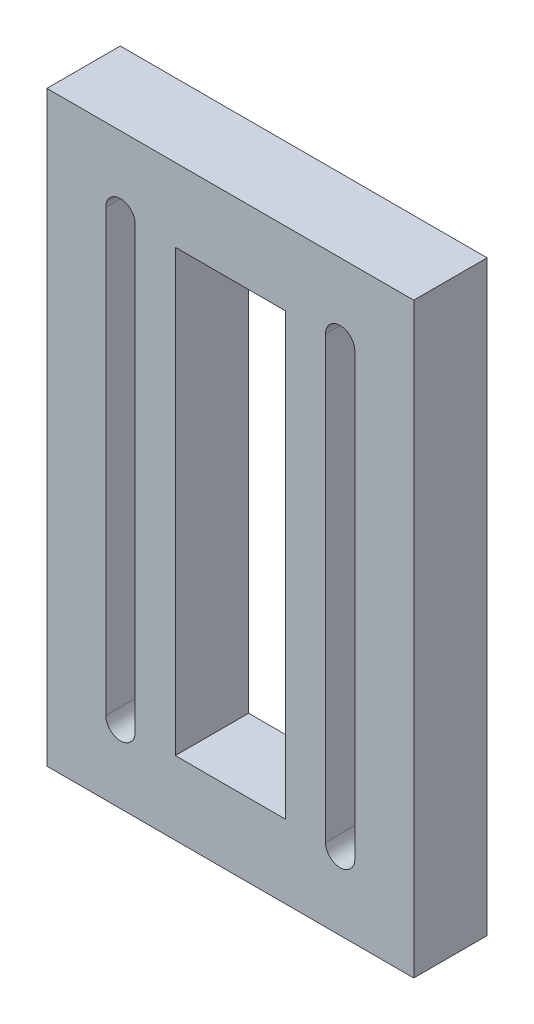
ISO-10303-21;
HEADER;
FILE_DESCRIPTION(('STEP AP214'),'2;1');
FILE_NAME('part.step','',(''),(''),'','','');
FILE_SCHEMA(('AUTOMOTIVE_DESIGN { 1 0 10303 214 1 1 1 1 }'));
ENDSEC;
DATA;
#1=APPLICATION_CONTEXT('core data for automotive mechanical design processes');
#2=APPLICATION_PROTOCOL_DEFINITION('international standard','automotive_design',2000,#1);
#3=PRODUCT_CONTEXT('',#1,'mechanical');
#4=PRODUCT('Part','Part','',(#3));
#5=PRODUCT_RELATED_PRODUCT_CATEGORY('part','',(#4));
#6=PRODUCT_DEFINITION_FORMATION('','',#4);
#7=PRODUCT_DEFINITION_CONTEXT('part definition',#1,'design');
#8=PRODUCT_DEFINITION('design','',#6,#7);
#9=PRODUCT_DEFINITION_SHAPE('','',#8);
#10=(LENGTH_UNIT() NAMED_UNIT(*) SI_UNIT(.MILLI.,.METRE.));
#11=(NAMED_UNIT(*) PLANE_ANGLE_UNIT() SI_UNIT($,.RADIAN.));
#12=(NAMED_UNIT(*) SI_UNIT($,.STERADIAN.) SOLID_ANGLE_UNIT());
#13=UNCERTAINTY_MEASURE_WITH_UNIT(LENGTH_MEASURE(1.E-05),#10,'distance_accuracy_value','');
#14=(GEOMETRIC_REPRESENTATION_CONTEXT(3) GLOBAL_UNCERTAINTY_ASSIGNED_CONTEXT((#13)) GLOBAL_UNIT_ASSIGNED_CONTEXT((#10,
#11,#12)) REPRESENTATION_CONTEXT('',''));
#15=CARTESIAN_POINT('',(0.,0.,0.));
#16=DIRECTION('',(0.,0.,1.));
#17=DIRECTION('',(1.,0.,0.));
#18=AXIS2_PLACEMENT_3D('',#15,#16,#17);
#19=CARTESIAN_POINT('',(20.0334967028434,0.,10.));
#20=DIRECTION('',(-1.,0.,0.));
#21=DIRECTION('',(0.,0.,1.));
#22=AXIS2_PLACEMENT_3D('',#19,#20,#21);
#23=PLANE('',#22);
#24=DIRECTION('',(0.,1.,0.));
#25=VECTOR('',#24,1.);
#26=CARTESIAN_POINT('',(20.0334967028434,0.,0.));
#27=LINE('',#26,#25);
#28=CARTESIAN_POINT('',(20.0334967028434,-30.,0.));
#29=VERTEX_POINT('',#28);
#30=CARTESIAN_POINT('',(20.0334967028434,30.,0.));
#31=VERTEX_POINT('',#30);
#32=EDGE_CURVE('E214',#29,#31,#27,.T.);
#33=ORIENTED_EDGE('',*,*,#32,.F.);
#34=DIRECTION('',(0.,0.,-1.));
#35=VECTOR('',#34,1.);
#36=CARTESIAN_POINT('',(20.0334967028434,-30.,10.));
#37=LINE('',#36,#35);
#38=CARTESIAN_POINT('',(20.0334967028434,-30.,10.));
#39=VERTEX_POINT('',#38);
#40=EDGE_CURVE('E11',#39,#29,#37,.T.);
#41=ORIENTED_EDGE('',*,*,#40,.F.);
#42=DIRECTION('',(0.,1.,0.));
#43=VECTOR('',#42,1.);
#44=CARTESIAN_POINT('',(20.0334967028434,0.,10.));
#45=LINE('',#44,#43);
#46=CARTESIAN_POINT('',(20.0334967028434,30.,10.));
#47=VERTEX_POINT('',#46);
#48=EDGE_CURVE('E164',#39,#47,#45,.T.);
#49=ORIENTED_EDGE('',*,*,#48,.T.);
#50=DIRECTION('',(0.,0.,-1.));
#51=VECTOR('',#50,1.);
#52=CARTESIAN_POINT('',(20.0334967028434,30.,10.));
#53=LINE('',#52,#51);
#54=EDGE_CURVE('E113',#47,#31,#53,.T.);
#55=ORIENTED_EDGE('',*,*,#54,.T.);
#56=EDGE_LOOP('',(#33,#41,#49,#55));
#57=FACE_BOUND('',#56,.T.);
#58=ADVANCED_FACE('F36',(#57),#23,.T.);
#59=CARTESIAN_POINT('',(18.0334967028434,-30.,10.));
#60=DIRECTION('',(0.,0.,-1.));
#61=DIRECTION('',(-1.,0.,0.));
#62=AXIS2_PLACEMENT_3D('',#59,#60,#61);
#63=CYLINDRICAL_SURFACE('',#62,2.);
#64=CARTESIAN_POINT('',(18.0334967028434,-30.,0.));
#65=DIRECTION('',(0.,0.,1.));
#66=DIRECTION('',(1.,0.,0.));
#67=AXIS2_PLACEMENT_3D('',#64,#65,#66);
#68=CIRCLE('',#67,2.);
#69=CARTESIAN_POINT('',(16.0334967028434,-30.,0.));
#70=VERTEX_POINT('',#69);
#71=EDGE_CURVE('E170',#29,#70,#68,.F.);
#72=ORIENTED_EDGE('',*,*,#71,.T.);
#73=DIRECTION('',(0.,0.,-1.));
#74=VECTOR('',#73,1.);
#75=CARTESIAN_POINT('',(16.0334967028434,-30.,10.));
#76=LINE('',#75,#74);
#77=CARTESIAN_POINT('',(16.0334967028434,-30.,10.));
#78=VERTEX_POINT('',#77);
#79=EDGE_CURVE('E46',#78,#70,#76,.T.);
#80=ORIENTED_EDGE('',*,*,#79,.F.);
#81=CARTESIAN_POINT('',(18.0334967028434,-30.,10.));
#82=DIRECTION('',(0.,0.,1.));
#83=DIRECTION('',(1.,0.,0.));
#84=AXIS2_PLACEMENT_3D('',#81,#82,#83);
#85=CIRCLE('',#84,2.);
#86=EDGE_CURVE('E159',#39,#78,#85,.F.);
#87=ORIENTED_EDGE('',*,*,#86,.F.);
#88=ORIENTED_EDGE('',*,*,#40,.T.);
#89=EDGE_LOOP('',(#72,#80,#87,#88));
#90=FACE_BOUND('',#89,.T.);
#91=ADVANCED_FACE('F168',(#90),#63,.F.);
#92=CARTESIAN_POINT('',(16.0334967028434,0.,10.));
#93=DIRECTION('',(1.,0.,0.));
#94=DIRECTION('',(0.,1.,0.));
#95=AXIS2_PLACEMENT_3D('',#92,#93,#94);
#96=PLANE('',#95);
#97=DIRECTION('',(0.,-1.,0.));
#98=VECTOR('',#97,1.);
#99=CARTESIAN_POINT('',(16.0334967028434,0.,0.));
#100=LINE('',#99,#98);
#101=CARTESIAN_POINT('',(16.0334967028434,30.,0.));
#102=VERTEX_POINT('',#101);
#103=EDGE_CURVE('E218',#102,#70,#100,.T.);
#104=ORIENTED_EDGE('',*,*,#103,.F.);
#105=DIRECTION('',(0.,0.,-1.));
#106=VECTOR('',#105,1.);
#107=CARTESIAN_POINT('',(16.0334967028434,30.,10.));
#108=LINE('',#107,#106);
#109=CARTESIAN_POINT('',(16.0334967028434,30.,10.));
#110=VERTEX_POINT('',#109);
#111=EDGE_CURVE('E106',#110,#102,#108,.T.);
#112=ORIENTED_EDGE('',*,*,#111,.F.);
#113=DIRECTION('',(0.,-1.,0.));
#114=VECTOR('',#113,1.);
#115=CARTESIAN_POINT('',(16.0334967028434,0.,10.));
#116=LINE('',#115,#114);
#117=EDGE_CURVE('E163',#110,#78,#116,.T.);
#118=ORIENTED_EDGE('',*,*,#117,.T.);
#119=ORIENTED_EDGE('',*,*,#79,.T.);
#120=EDGE_LOOP('',(#104,#112,#118,#119));
#121=FACE_BOUND('',#120,.T.);
#122=ADVANCED_FACE('F175',(#121),#96,.T.);
#123=CARTESIAN_POINT('',(-11.9040776644208,-30.,10.));
#124=DIRECTION('',(0.,0.,-1.));
#125=DIRECTION('',(-1.,0.,0.));
#126=AXIS2_PLACEMENT_3D('',#123,#124,#125);
#127=CYLINDRICAL_SURFACE('',#126,2.);
#128=CARTESIAN_POINT('',(-11.9040776644208,-30.,0.));
#129=DIRECTION('',(0.,0.,1.));
#130=DIRECTION('',(1.,0.,0.));
#131=AXIS2_PLACEMENT_3D('',#128,#129,#130);
#132=CIRCLE('',#131,2.);
#133=CARTESIAN_POINT('',(-13.9040776644208,-30.,0.));
#134=VERTEX_POINT('',#133);
#135=CARTESIAN_POINT('',(-9.90407766442081,-30.,0.));
#136=VERTEX_POINT('',#135);
#137=EDGE_CURVE('E202',#134,#136,#132,.T.);
#138=ORIENTED_EDGE('',*,*,#137,.F.);
#139=DIRECTION('',(0.,0.,-1.));
#140=VECTOR('',#139,1.);
#141=CARTESIAN_POINT('',(-13.9040776644208,-30.,10.));
#142=LINE('',#141,#140);
#143=CARTESIAN_POINT('',(-13.9040776644208,-30.,10.));
#144=VERTEX_POINT('',#143);
#145=EDGE_CURVE('E224',#144,#134,#142,.T.);
#146=ORIENTED_EDGE('',*,*,#145,.F.);
#147=CARTESIAN_POINT('',(-11.9040776644208,-30.,10.));
#148=DIRECTION('',(0.,0.,1.));
#149=DIRECTION('',(1.,0.,0.));
#150=AXIS2_PLACEMENT_3D('',#147,#148,#149);
#151=CIRCLE('',#150,2.);
#152=CARTESIAN_POINT('',(-9.90407766442081,-30.,10.));
#153=VERTEX_POINT('',#152);
#154=EDGE_CURVE('E285',#144,#153,#151,.T.);
#155=ORIENTED_EDGE('',*,*,#154,.T.);
#156=DIRECTION('',(0.,0.,-1.));
#157=VECTOR('',#156,1.);
#158=CARTESIAN_POINT('',(-9.90407766442081,-30.,10.));
#159=LINE('',#158,#157);
#160=EDGE_CURVE('E226',#153,#136,#159,.T.);
#161=ORIENTED_EDGE('',*,*,#160,.T.);
#162=EDGE_LOOP('',(#138,#146,#155,#161));
#163=FACE_BOUND('',#162,.T.);
#164=ADVANCED_FACE('F327',(#163),#127,.F.);
#165=CARTESIAN_POINT('',(-13.9040776644208,0.,10.));
#166=DIRECTION('',(1.,0.,0.));
#167=DIRECTION('',(0.,1.,0.));
#168=AXIS2_PLACEMENT_3D('',#165,#166,#167);
#169=PLANE('',#168);
#170=DIRECTION('',(0.,-1.,0.));
#171=VECTOR('',#170,1.);
#172=CARTESIAN_POINT('',(-13.9040776644208,0.,0.));
#173=LINE('',#172,#171);
#174=CARTESIAN_POINT('',(-13.9040776644208,30.,0.));
#175=VERTEX_POINT('',#174);
#176=EDGE_CURVE('E205',#175,#134,#173,.T.);
#177=ORIENTED_EDGE('',*,*,#176,.F.);
#178=DIRECTION('',(0.,0.,-1.));
#179=VECTOR('',#178,1.);
#180=CARTESIAN_POINT('',(-13.9040776644208,30.,10.));
#181=LINE('',#180,#179);
#182=CARTESIAN_POINT('',(-13.9040776644208,30.,10.));
#183=VERTEX_POINT('',#182);
#184=EDGE_CURVE('E232',#183,#175,#181,.T.);
#185=ORIENTED_EDGE('',*,*,#184,.F.);
#186=DIRECTION('',(0.,-1.,0.));
#187=VECTOR('',#186,1.);
#188=CARTESIAN_POINT('',(-13.9040776644208,0.,10.));
#189=LINE('',#188,#187);
#190=EDGE_CURVE('E288',#183,#144,#189,.T.);
#191=ORIENTED_EDGE('',*,*,#190,.T.);
#192=ORIENTED_EDGE('',*,*,#145,.T.);
#193=EDGE_LOOP('',(#177,#185,#191,#192));
#194=FACE_BOUND('',#193,.T.);
#195=ADVANCED_FACE('F323',(#194),#169,.T.);
#196=CARTESIAN_POINT('',(-11.9040776644208,30.,10.));
#197=DIRECTION('',(0.,0.,-1.));
#198=DIRECTION('',(-1.,0.,0.));
#199=AXIS2_PLACEMENT_3D('',#196,#197,#198);
#200=CYLINDRICAL_SURFACE('',#199,2.);
#201=CARTESIAN_POINT('',(-11.9040776644208,30.,0.));
#202=DIRECTION('',(0.,0.,1.));
#203=DIRECTION('',(1.,0.,0.));
#204=AXIS2_PLACEMENT_3D('',#201,#202,#203);
#205=CIRCLE('',#204,2.);
#206=CARTESIAN_POINT('',(-9.90407766442082,30.,0.));
#207=VERTEX_POINT('',#206);
#208=EDGE_CURVE('E208',#175,#207,#205,.F.);
#209=ORIENTED_EDGE('',*,*,#208,.T.);
#210=DIRECTION('',(0.,0.,-1.));
#211=VECTOR('',#210,1.);
#212=CARTESIAN_POINT('',(-9.90407766442082,30.,10.));
#213=LINE('',#212,#211);
#214=CARTESIAN_POINT('',(-9.90407766442082,30.,10.));
#215=VERTEX_POINT('',#214);
#216=EDGE_CURVE('E228',#215,#207,#213,.T.);
#217=ORIENTED_EDGE('',*,*,#216,.F.);
#218=CARTESIAN_POINT('',(-11.9040776644208,30.,10.));
#219=DIRECTION('',(0.,0.,1.));
#220=DIRECTION('',(1.,0.,0.));
#221=AXIS2_PLACEMENT_3D('',#218,#219,#220);
#222=CIRCLE('',#221,2.);
#223=EDGE_CURVE('E291',#183,#215,#222,.F.);
#224=ORIENTED_EDGE('',*,*,#223,.F.);
#225=ORIENTED_EDGE('',*,*,#184,.T.);
#226=EDGE_LOOP('',(#209,#217,#224,#225));
#227=FACE_BOUND('',#226,.T.);
#228=ADVANCED_FACE('F319',(#227),#200,.F.);
#229=CARTESIAN_POINT('',(28.0647095192113,0.,10.));
#230=DIRECTION('',(1.,0.,0.));
#231=DIRECTION('',(0.,0.,-1.));
#232=AXIS2_PLACEMENT_3D('',#229,#230,#231);
#233=PLANE('',#232);
#234=DIRECTION('',(0.,-1.,0.));
#235=VECTOR('',#234,1.);
#236=CARTESIAN_POINT('',(28.0647095192113,0.,0.));
#237=LINE('',#236,#235);
#238=CARTESIAN_POINT('',(28.0647095192113,40.,0.));
#239=VERTEX_POINT('',#238);
#240=CARTESIAN_POINT('',(28.0647095192113,-40.,0.));
#241=VERTEX_POINT('',#240);
#242=EDGE_CURVE('E190',#239,#241,#237,.T.);
#243=ORIENTED_EDGE('',*,*,#242,.F.);
#244=DIRECTION('',(0.,0.,-1.));
#245=VECTOR('',#244,1.);
#246=CARTESIAN_POINT('',(28.0647095192113,40.,10.));
#247=LINE('',#246,#245);
#248=CARTESIAN_POINT('',(28.0647095192113,40.,10.));
#249=VERTEX_POINT('',#248);
#250=EDGE_CURVE('E229',#249,#239,#247,.T.);
#251=ORIENTED_EDGE('',*,*,#250,.F.);
#252=DIRECTION('',(0.,-1.,0.));
#253=VECTOR('',#252,1.);
#254=CARTESIAN_POINT('',(28.0647095192113,0.,10.));
#255=LINE('',#254,#253);
#256=CARTESIAN_POINT('',(28.0647095192113,-40.,10.));
#257=VERTEX_POINT('',#256);
#258=EDGE_CURVE('E269',#249,#257,#255,.T.);
#259=ORIENTED_EDGE('',*,*,#258,.T.);
#260=DIRECTION('',(0.,0.,-1.));
#261=VECTOR('',#260,1.);
#262=CARTESIAN_POINT('',(28.0647095192113,-40.,10.));
#263=LINE('',#262,#261);
#264=EDGE_CURVE('E235',#257,#241,#263,.T.);
#265=ORIENTED_EDGE('',*,*,#264,.T.);
#266=EDGE_LOOP('',(#243,#251,#259,#265));
#267=FACE_BOUND('',#266,.T.);
#268=ADVANCED_FACE('F322',(#267),#233,.T.);
#269=CARTESIAN_POINT('',(0.,40.,10.));
#270=DIRECTION('',(0.,1.,0.));
#271=DIRECTION('',(0.,0.,1.));
#272=AXIS2_PLACEMENT_3D('',#269,#270,#271);
#273=PLANE('',#272);
#274=DIRECTION('',(1.,0.,0.));
#275=VECTOR('',#274,1.);
#276=CARTESIAN_POINT('',(0.,40.,0.));
#277=LINE('',#276,#275);
#278=CARTESIAN_POINT('',(-21.9352904807887,40.,0.));
#279=VERTEX_POINT('',#278);
#280=EDGE_CURVE('E193',#279,#239,#277,.T.);
#281=ORIENTED_EDGE('',*,*,#280,.F.);
#282=DIRECTION('',(0.,0.,-1.));
#283=VECTOR('',#282,1.);
#284=CARTESIAN_POINT('',(-21.9352904807887,40.,10.));
#285=LINE('',#284,#283);
#286=CARTESIAN_POINT('',(-21.9352904807887,40.,10.));
#287=VERTEX_POINT('',#286);
#288=EDGE_CURVE('E240',#287,#279,#285,.T.);
#289=ORIENTED_EDGE('',*,*,#288,.F.);
#290=DIRECTION('',(1.,0.,0.));
#291=VECTOR('',#290,1.);
#292=CARTESIAN_POINT('',(0.,40.,10.));
#293=LINE('',#292,#291);
#294=EDGE_CURVE('E273',#287,#249,#293,.T.);
#295=ORIENTED_EDGE('',*,*,#294,.T.);
#296=ORIENTED_EDGE('',*,*,#250,.T.);
#297=EDGE_LOOP('',(#281,#289,#295,#296));
#298=FACE_BOUND('',#297,.T.);
#299=ADVANCED_FACE('F338',(#298),#273,.T.);
#300=CARTESIAN_POINT('',(-21.9352904807887,0.,10.));
#301=DIRECTION('',(1.,0.,0.));
#302=DIRECTION('',(0.,0.,-1.));
#303=AXIS2_PLACEMENT_3D('',#300,#301,#302);
#304=PLANE('',#303);
#305=DIRECTION('',(0.,-1.,0.));
#306=VECTOR('',#305,1.);
#307=CARTESIAN_POINT('',(-21.9352904807887,0.,0.));
#308=LINE('',#307,#306);
#309=CARTESIAN_POINT('',(-21.9352904807887,-40.,0.));
#310=VERTEX_POINT('',#309);
#311=EDGE_CURVE('E196',#279,#310,#308,.T.);
#312=ORIENTED_EDGE('',*,*,#311,.T.);
#313=DIRECTION('',(0.,0.,-1.));
#314=VECTOR('',#313,1.);
#315=CARTESIAN_POINT('',(-21.9352904807887,-40.,10.));
#316=LINE('',#315,#314);
#317=CARTESIAN_POINT('',(-21.9352904807887,-40.,10.));
#318=VERTEX_POINT('',#317);
#319=EDGE_CURVE('E237',#318,#310,#316,.T.);
#320=ORIENTED_EDGE('',*,*,#319,.F.);
#321=DIRECTION('',(0.,-1.,0.));
#322=VECTOR('',#321,1.);
#323=CARTESIAN_POINT('',(-21.9352904807887,0.,10.));
#324=LINE('',#323,#322);
#325=EDGE_CURVE('E280',#287,#318,#324,.T.);
#326=ORIENTED_EDGE('',*,*,#325,.F.);
#327=ORIENTED_EDGE('',*,*,#288,.T.);
#328=EDGE_LOOP('',(#312,#320,#326,#327));
#329=FACE_BOUND('',#328,.T.);
#330=ADVANCED_FACE('F335',(#329),#304,.F.);
#331=CARTESIAN_POINT('',(0.,-30.,10.));
#332=DIRECTION('',(0.,-1.,0.));
#333=DIRECTION('',(1.,0.,0.));
#334=AXIS2_PLACEMENT_3D('',#331,#332,#333);
#335=PLANE('',#334);
#336=DIRECTION('',(-1.,0.,0.));
#337=VECTOR('',#336,1.);
#338=CARTESIAN_POINT('',(0.,-30.,0.));
#339=LINE('',#338,#337);
#340=CARTESIAN_POINT('',(10.5647095192113,-30.,0.));
#341=VERTEX_POINT('',#340);
#342=CARTESIAN_POINT('',(-4.43529048078872,-30.,0.));
#343=VERTEX_POINT('',#342);
#344=EDGE_CURVE('E181',#341,#343,#339,.T.);
#345=ORIENTED_EDGE('',*,*,#344,.T.);
#346=DIRECTION('',(0.,0.,-1.));
#347=VECTOR('',#346,1.);
#348=CARTESIAN_POINT('',(-4.43529048078872,-30.,10.));
#349=LINE('',#348,#347);
#350=CARTESIAN_POINT('',(-4.43529048078872,-30.,10.));
#351=VERTEX_POINT('',#350);
#352=EDGE_CURVE('E40',#351,#343,#349,.T.);
#353=ORIENTED_EDGE('',*,*,#352,.F.);
#354=DIRECTION('',(-1.,0.,0.));
#355=VECTOR('',#354,1.);
#356=CARTESIAN_POINT('',(0.,-30.,10.));
#357=LINE('',#356,#355);
#358=CARTESIAN_POINT('',(10.5647095192113,-30.,10.));
#359=VERTEX_POINT('',#358);
#360=EDGE_CURVE('E222',#359,#351,#357,.T.);
#361=ORIENTED_EDGE('',*,*,#360,.F.);
#362=DIRECTION('',(0.,0.,-1.));
#363=VECTOR('',#362,1.);
#364=CARTESIAN_POINT('',(10.5647095192113,-30.,10.));
#365=LINE('',#364,#363);
#366=EDGE_CURVE('E177',#359,#341,#365,.T.);
#367=ORIENTED_EDGE('',*,*,#366,.T.);
#368=EDGE_LOOP('',(#345,#353,#361,#367));
#369=FACE_BOUND('',#368,.T.);
#370=ADVANCED_FACE('F38',(#369),#335,.F.);
#371=CARTESIAN_POINT('',(-4.43529048078872,0.,10.));
#372=DIRECTION('',(-1.,0.,0.));
#373=DIRECTION('',(0.,0.,1.));
#374=AXIS2_PLACEMENT_3D('',#371,#372,#373);
#375=PLANE('',#374);
#376=DIRECTION('',(0.,1.,0.));
#377=VECTOR('',#376,1.);
#378=CARTESIAN_POINT('',(-4.43529048078872,0.,0.));
#379=LINE('',#378,#377);
#380=CARTESIAN_POINT('',(-4.43529048078872,30.,0.));
#381=VERTEX_POINT('',#380);
#382=EDGE_CURVE('E184',#343,#381,#379,.T.);
#383=ORIENTED_EDGE('',*,*,#382,.T.);
#384=DIRECTION('',(0.,0.,-1.));
#385=VECTOR('',#384,1.);
#386=CARTESIAN_POINT('',(-4.43529048078872,30.,10.));
#387=LINE('',#386,#385);
#388=CARTESIAN_POINT('',(-4.43529048078872,30.,10.));
#389=VERTEX_POINT('',#388);
#390=EDGE_CURVE('E247',#389,#381,#387,.T.);
#391=ORIENTED_EDGE('',*,*,#390,.F.);
#392=DIRECTION('',(0.,1.,0.));
#393=VECTOR('',#392,1.);
#394=CARTESIAN_POINT('',(-4.43529048078872,0.,10.));
#395=LINE('',#394,#393);
#396=EDGE_CURVE('E121',#351,#389,#395,.T.);
#397=ORIENTED_EDGE('',*,*,#396,.F.);
#398=ORIENTED_EDGE('',*,*,#352,.T.);
#399=EDGE_LOOP('',(#383,#391,#397,#398));
#400=FACE_BOUND('',#399,.T.);
#401=ADVANCED_FACE('F253',(#400),#375,.F.);
#402=CARTESIAN_POINT('',(0.,30.,10.));
#403=DIRECTION('',(0.,1.,0.));
#404=DIRECTION('',(-1.,0.,0.));
#405=AXIS2_PLACEMENT_3D('',#402,#403,#404);
#406=PLANE('',#405);
#407=DIRECTION('',(1.,0.,0.));
#408=VECTOR('',#407,1.);
#409=CARTESIAN_POINT('',(0.,30.,0.));
#410=LINE('',#409,#408);
#411=CARTESIAN_POINT('',(10.5647095192113,30.,0.));
#412=VERTEX_POINT('',#411);
#413=EDGE_CURVE('E186',#381,#412,#410,.T.);
#414=ORIENTED_EDGE('',*,*,#413,.T.);
#415=DIRECTION('',(0.,0.,-1.));
#416=VECTOR('',#415,1.);
#417=CARTESIAN_POINT('',(10.5647095192113,30.,10.));
#418=LINE('',#417,#416);
#419=CARTESIAN_POINT('',(10.5647095192113,30.,10.));
#420=VERTEX_POINT('',#419);
#421=EDGE_CURVE('E245',#420,#412,#418,.T.);
#422=ORIENTED_EDGE('',*,*,#421,.F.);
#423=DIRECTION('',(1.,0.,0.));
#424=VECTOR('',#423,1.);
#425=CARTESIAN_POINT('',(0.,30.,10.));
#426=LINE('',#425,#424);
#427=EDGE_CURVE('E270',#389,#420,#426,.T.);
#428=ORIENTED_EDGE('',*,*,#427,.F.);
#429=ORIENTED_EDGE('',*,*,#390,.T.);
#430=EDGE_LOOP('',(#414,#422,#428,#429));
#431=FACE_BOUND('',#430,.T.);
#432=ADVANCED_FACE('F263',(#431),#406,.F.);
#433=CARTESIAN_POINT('',(-9.90407766442081,0.,10.));
#434=DIRECTION('',(1.,0.,0.));
#435=DIRECTION('',(0.,1.,0.));
#436=AXIS2_PLACEMENT_3D('',#433,#434,#435);
#437=PLANE('',#436);
#438=DIRECTION('',(0.,-1.,0.));
#439=VECTOR('',#438,1.);
#440=CARTESIAN_POINT('',(-9.90407766442081,0.,0.));
#441=LINE('',#440,#439);
#442=EDGE_CURVE('E211',#207,#136,#441,.T.);
#443=ORIENTED_EDGE('',*,*,#442,.T.);
#444=ORIENTED_EDGE('',*,*,#160,.F.);
#445=DIRECTION('',(0.,-1.,0.));
#446=VECTOR('',#445,1.);
#447=CARTESIAN_POINT('',(-9.90407766442081,0.,10.));
#448=LINE('',#447,#446);
#449=EDGE_CURVE('E294',#215,#153,#448,.T.);
#450=ORIENTED_EDGE('',*,*,#449,.F.);
#451=ORIENTED_EDGE('',*,*,#216,.T.);
#452=EDGE_LOOP('',(#443,#444,#450,#451));
#453=FACE_BOUND('',#452,.T.);
#454=ADVANCED_FACE('F315',(#453),#437,.F.);
#455=CARTESIAN_POINT('',(0.,-40.,10.));
#456=DIRECTION('',(0.,1.,0.));
#457=DIRECTION('',(0.,0.,1.));
#458=AXIS2_PLACEMENT_3D('',#455,#456,#457);
#459=PLANE('',#458);
#460=DIRECTION('',(1.,0.,0.));
#461=VECTOR('',#460,1.);
#462=CARTESIAN_POINT('',(0.,-40.,0.));
#463=LINE('',#462,#461);
#464=EDGE_CURVE('E199',#310,#241,#463,.T.);
#465=ORIENTED_EDGE('',*,*,#464,.T.);
#466=ORIENTED_EDGE('',*,*,#264,.F.);
#467=DIRECTION('',(1.,0.,0.));
#468=VECTOR('',#467,1.);
#469=CARTESIAN_POINT('',(0.,-40.,10.));
#470=LINE('',#469,#468);
#471=EDGE_CURVE('E283',#318,#257,#470,.T.);
#472=ORIENTED_EDGE('',*,*,#471,.F.);
#473=ORIENTED_EDGE('',*,*,#319,.T.);
#474=EDGE_LOOP('',(#465,#466,#472,#473));
#475=FACE_BOUND('',#474,.T.);
#476=ADVANCED_FACE('F304',(#475),#459,.F.);
#477=CARTESIAN_POINT('',(10.5647095192113,0.,10.));
#478=DIRECTION('',(1.,0.,0.));
#479=DIRECTION('',(0.,0.,-1.));
#480=AXIS2_PLACEMENT_3D('',#477,#478,#479);
#481=PLANE('',#480);
#482=DIRECTION('',(0.,-1.,0.));
#483=VECTOR('',#482,1.);
#484=CARTESIAN_POINT('',(10.5647095192113,0.,0.));
#485=LINE('',#484,#483);
#486=EDGE_CURVE('E188',#412,#341,#485,.T.);
#487=ORIENTED_EDGE('',*,*,#486,.T.);
#488=ORIENTED_EDGE('',*,*,#366,.F.);
#489=DIRECTION('',(0.,-1.,0.));
#490=VECTOR('',#489,1.);
#491=CARTESIAN_POINT('',(10.5647095192113,0.,10.));
#492=LINE('',#491,#490);
#493=EDGE_CURVE('E267',#420,#359,#492,.T.);
#494=ORIENTED_EDGE('',*,*,#493,.F.);
#495=ORIENTED_EDGE('',*,*,#421,.T.);
#496=EDGE_LOOP('',(#487,#488,#494,#495));
#497=FACE_BOUND('',#496,.T.);
#498=ADVANCED_FACE('F266',(#497),#481,.F.);
#499=CARTESIAN_POINT('',(18.0334967028434,30.,10.));
#500=DIRECTION('',(0.,0.,-1.));
#501=DIRECTION('',(-1.,0.,0.));
#502=AXIS2_PLACEMENT_3D('',#499,#500,#501);
#503=CYLINDRICAL_SURFACE('',#502,2.);
#504=CARTESIAN_POINT('',(18.0334967028434,30.,0.));
#505=DIRECTION('',(0.,0.,1.));
#506=DIRECTION('',(1.,0.,0.));
#507=AXIS2_PLACEMENT_3D('',#504,#505,#506);
#508=CIRCLE('',#507,2.);
#509=EDGE_CURVE('E220',#102,#31,#508,.F.);
#510=ORIENTED_EDGE('',*,*,#509,.T.);
#511=ORIENTED_EDGE('',*,*,#54,.F.);
#512=CARTESIAN_POINT('',(18.0334967028434,30.,10.));
#513=DIRECTION('',(0.,0.,1.));
#514=DIRECTION('',(1.,0.,0.));
#515=AXIS2_PLACEMENT_3D('',#512,#513,#514);
#516=CIRCLE('',#515,2.);
#517=EDGE_CURVE('E55',#110,#47,#516,.F.);
#518=ORIENTED_EDGE('',*,*,#517,.F.);
#519=ORIENTED_EDGE('',*,*,#111,.T.);
#520=EDGE_LOOP('',(#510,#511,#518,#519));
#521=FACE_BOUND('',#520,.T.);
#522=ADVANCED_FACE('F296',(#521),#503,.F.);
#523=CARTESIAN_POINT('',(0.,0.,10.));
#524=DIRECTION('',(0.,0.,1.));
#525=DIRECTION('',(1.,0.,0.));
#526=AXIS2_PLACEMENT_3D('',#523,#524,#525);
#527=PLANE('',#526);
#528=ORIENTED_EDGE('',*,*,#360,.T.);
#529=ORIENTED_EDGE('',*,*,#396,.T.);
#530=ORIENTED_EDGE('',*,*,#427,.T.);
#531=ORIENTED_EDGE('',*,*,#493,.T.);
#532=EDGE_LOOP('',(#528,#529,#530,#531));
#533=FACE_BOUND('',#532,.T.);
#534=ORIENTED_EDGE('',*,*,#258,.F.);
#535=ORIENTED_EDGE('',*,*,#294,.F.);
#536=ORIENTED_EDGE('',*,*,#325,.T.);
#537=ORIENTED_EDGE('',*,*,#471,.T.);
#538=EDGE_LOOP('',(#534,#535,#536,#537));
#539=FACE_BOUND('',#538,.T.);
#540=ORIENTED_EDGE('',*,*,#154,.F.);
#541=ORIENTED_EDGE('',*,*,#190,.F.);
#542=ORIENTED_EDGE('',*,*,#223,.T.);
#543=ORIENTED_EDGE('',*,*,#449,.T.);
#544=EDGE_LOOP('',(#540,#541,#542,#543));
#545=FACE_BOUND('',#544,.T.);
#546=ORIENTED_EDGE('',*,*,#48,.F.);
#547=ORIENTED_EDGE('',*,*,#86,.T.);
#548=ORIENTED_EDGE('',*,*,#117,.F.);
#549=ORIENTED_EDGE('',*,*,#517,.T.);
#550=EDGE_LOOP('',(#546,#547,#548,#549));
#551=FACE_BOUND('',#550,.T.);
#552=ADVANCED_FACE('F161',(#533,#539,#545,#551),#527,.T.);
#553=CARTESIAN_POINT('',(0.,0.,0.));
#554=DIRECTION('',(0.,0.,1.));
#555=DIRECTION('',(1.,0.,0.));
#556=AXIS2_PLACEMENT_3D('',#553,#554,#555);
#557=PLANE('',#556);
#558=ORIENTED_EDGE('',*,*,#344,.F.);
#559=ORIENTED_EDGE('',*,*,#486,.F.);
#560=ORIENTED_EDGE('',*,*,#413,.F.);
#561=ORIENTED_EDGE('',*,*,#382,.F.);
#562=EDGE_LOOP('',(#558,#559,#560,#561));
#563=FACE_BOUND('',#562,.T.);
#564=ORIENTED_EDGE('',*,*,#242,.T.);
#565=ORIENTED_EDGE('',*,*,#464,.F.);
#566=ORIENTED_EDGE('',*,*,#311,.F.);
#567=ORIENTED_EDGE('',*,*,#280,.T.);
#568=EDGE_LOOP('',(#564,#565,#566,#567));
#569=FACE_BOUND('',#568,.T.);
#570=ORIENTED_EDGE('',*,*,#137,.T.);
#571=ORIENTED_EDGE('',*,*,#442,.F.);
#572=ORIENTED_EDGE('',*,*,#208,.F.);
#573=ORIENTED_EDGE('',*,*,#176,.T.);
#574=EDGE_LOOP('',(#570,#571,#572,#573));
#575=FACE_BOUND('',#574,.T.);
#576=ORIENTED_EDGE('',*,*,#32,.T.);
#577=ORIENTED_EDGE('',*,*,#509,.F.);
#578=ORIENTED_EDGE('',*,*,#103,.T.);
#579=ORIENTED_EDGE('',*,*,#71,.F.);
#580=EDGE_LOOP('',(#576,#577,#578,#579));
#581=FACE_BOUND('',#580,.T.);
#582=ADVANCED_FACE('F260',(#563,#569,#575,#581),#557,.F.);
#583=CLOSED_SHELL('',(#58,#91,#122,#164,#195,#228,#268,#299,#330,#370,#401,#432,#454,#476,#498,
#522,#552,#582));
#584=MANIFOLD_SOLID_BREP('B2',#583);
#585=ADVANCED_BREP_SHAPE_REPRESENTATION('',(#18,#584),#14);
#586=SHAPE_DEFINITION_REPRESENTATION(#9,#585);
ENDSEC;
END-ISO-10303-21;
